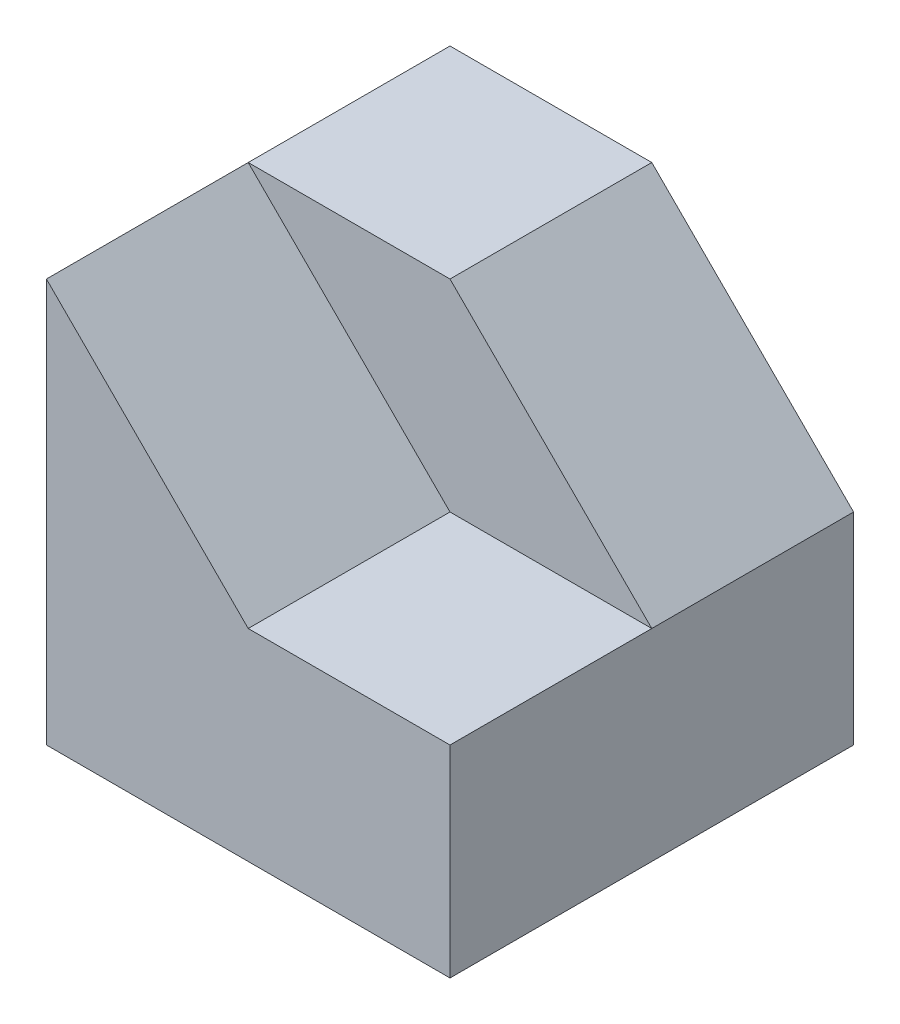
ISO-10303-21;
HEADER;
FILE_DESCRIPTION(('STEP AP214'),'2;1');
FILE_NAME('part.step','',(''),(''),'','','');
FILE_SCHEMA(('AUTOMOTIVE_DESIGN { 1 0 10303 214 1 1 1 1 }'));
ENDSEC;
DATA;
#1=APPLICATION_CONTEXT('core data for automotive mechanical design processes');
#2=APPLICATION_PROTOCOL_DEFINITION('international standard','automotive_design',2000,#1);
#3=PRODUCT_CONTEXT('',#1,'mechanical');
#4=PRODUCT('Part','Part','',(#3));
#5=PRODUCT_RELATED_PRODUCT_CATEGORY('part','',(#4));
#6=PRODUCT_DEFINITION_FORMATION('','',#4);
#7=PRODUCT_DEFINITION_CONTEXT('part definition',#1,'design');
#8=PRODUCT_DEFINITION('design','',#6,#7);
#9=PRODUCT_DEFINITION_SHAPE('','',#8);
#10=(LENGTH_UNIT() NAMED_UNIT(*) SI_UNIT(.MILLI.,.METRE.));
#11=(NAMED_UNIT(*) PLANE_ANGLE_UNIT() SI_UNIT($,.RADIAN.));
#12=(NAMED_UNIT(*) SI_UNIT($,.STERADIAN.) SOLID_ANGLE_UNIT());
#13=UNCERTAINTY_MEASURE_WITH_UNIT(LENGTH_MEASURE(1.E-05),#10,'distance_accuracy_value','');
#14=(GEOMETRIC_REPRESENTATION_CONTEXT(3) GLOBAL_UNCERTAINTY_ASSIGNED_CONTEXT((#13)) GLOBAL_UNIT_ASSIGNED_CONTEXT((#10,
#11,#12)) REPRESENTATION_CONTEXT('',''));
#15=CARTESIAN_POINT('',(0.,0.,0.));
#16=DIRECTION('',(0.,0.,1.));
#17=DIRECTION('',(1.,0.,0.));
#18=AXIS2_PLACEMENT_3D('',#15,#16,#17);
#19=CARTESIAN_POINT('',(30.,60.,-60.));
#20=DIRECTION('',(0.,1.,0.));
#21=DIRECTION('',(-1.,0.,0.));
#22=AXIS2_PLACEMENT_3D('',#19,#20,#21);
#23=PLANE('',#22);
#24=DIRECTION('',(0.,0.,1.));
#25=VECTOR('',#24,1.);
#26=CARTESIAN_POINT('',(0.,60.,-60.));
#27=LINE('',#26,#25);
#28=CARTESIAN_POINT('',(0.,60.,-60.));
#29=VERTEX_POINT('',#28);
#30=CARTESIAN_POINT('',(0.,60.,-30.));
#31=VERTEX_POINT('',#30);
#32=EDGE_CURVE('E36',#29,#31,#27,.T.);
#33=ORIENTED_EDGE('',*,*,#32,.T.);
#34=DIRECTION('',(-1.,0.,0.));
#35=VECTOR('',#34,1.);
#36=CARTESIAN_POINT('',(30.,60.,-30.));
#37=LINE('',#36,#35);
#38=CARTESIAN_POINT('',(30.,60.,-30.));
#39=VERTEX_POINT('',#38);
#40=EDGE_CURVE('E121',#39,#31,#37,.T.);
#41=ORIENTED_EDGE('',*,*,#40,.F.);
#42=DIRECTION('',(0.,0.,1.));
#43=VECTOR('',#42,1.);
#44=CARTESIAN_POINT('',(30.,60.,-60.));
#45=LINE('',#44,#43);
#46=CARTESIAN_POINT('',(30.,60.,-60.));
#47=VERTEX_POINT('',#46);
#48=EDGE_CURVE('E11',#47,#39,#45,.T.);
#49=ORIENTED_EDGE('',*,*,#48,.F.);
#50=DIRECTION('',(-1.,0.,0.));
#51=VECTOR('',#50,1.);
#52=CARTESIAN_POINT('',(30.,60.,-60.));
#53=LINE('',#52,#51);
#54=EDGE_CURVE('E106',#47,#29,#53,.T.);
#55=ORIENTED_EDGE('',*,*,#54,.T.);
#56=EDGE_LOOP('',(#33,#41,#49,#55));
#57=FACE_BOUND('',#56,.T.);
#58=ADVANCED_FACE('F33',(#57),#23,.T.);
#59=CARTESIAN_POINT('',(60.,30.,-60.));
#60=DIRECTION('',(0.707106781186548,0.707106781186547,0.));
#61=DIRECTION('',(-0.707106781186547,0.707106781186548,0.));
#62=AXIS2_PLACEMENT_3D('',#59,#60,#61);
#63=PLANE('',#62);
#64=ORIENTED_EDGE('',*,*,#48,.T.);
#65=DIRECTION('',(-0.707106781186547,0.707106781186548,0.));
#66=VECTOR('',#65,1.);
#67=CARTESIAN_POINT('',(60.,30.,-30.));
#68=LINE('',#67,#66);
#69=CARTESIAN_POINT('',(60.,30.,-30.));
#70=VERTEX_POINT('',#69);
#71=EDGE_CURVE('E150',#70,#39,#68,.T.);
#72=ORIENTED_EDGE('',*,*,#71,.F.);
#73=DIRECTION('',(0.,0.,1.));
#74=VECTOR('',#73,1.);
#75=CARTESIAN_POINT('',(60.,30.,-60.));
#76=LINE('',#75,#74);
#77=CARTESIAN_POINT('',(60.,30.,-60.));
#78=VERTEX_POINT('',#77);
#79=EDGE_CURVE('E42',#78,#70,#76,.T.);
#80=ORIENTED_EDGE('',*,*,#79,.F.);
#81=DIRECTION('',(-0.707106781186547,0.707106781186548,0.));
#82=VECTOR('',#81,1.);
#83=CARTESIAN_POINT('',(60.,30.,-60.));
#84=LINE('',#83,#82);
#85=EDGE_CURVE('E101',#78,#47,#84,.T.);
#86=ORIENTED_EDGE('',*,*,#85,.T.);
#87=EDGE_LOOP('',(#64,#72,#80,#86));
#88=FACE_BOUND('',#87,.T.);
#89=ADVANCED_FACE('F154',(#88),#63,.T.);
#90=CARTESIAN_POINT('',(60.,0.,-60.));
#91=DIRECTION('',(1.,0.,0.));
#92=DIRECTION('',(0.,1.,0.));
#93=AXIS2_PLACEMENT_3D('',#90,#91,#92);
#94=PLANE('',#93);
#95=DIRECTION('',(0.,1.,0.));
#96=VECTOR('',#95,1.);
#97=CARTESIAN_POINT('',(60.,0.,0.));
#98=LINE('',#97,#96);
#99=CARTESIAN_POINT('',(60.,0.,0.));
#100=VERTEX_POINT('',#99);
#101=CARTESIAN_POINT('',(60.,30.,0.));
#102=VERTEX_POINT('',#101);
#103=EDGE_CURVE('E93',#100,#102,#98,.T.);
#104=ORIENTED_EDGE('',*,*,#103,.F.);
#105=DIRECTION('',(0.,0.,1.));
#106=VECTOR('',#105,1.);
#107=CARTESIAN_POINT('',(60.,0.,-60.));
#108=LINE('',#107,#106);
#109=CARTESIAN_POINT('',(60.,0.,-60.));
#110=VERTEX_POINT('',#109);
#111=EDGE_CURVE('E72',#110,#100,#108,.T.);
#112=ORIENTED_EDGE('',*,*,#111,.F.);
#113=DIRECTION('',(0.,1.,0.));
#114=VECTOR('',#113,1.);
#115=CARTESIAN_POINT('',(60.,0.,-60.));
#116=LINE('',#115,#114);
#117=EDGE_CURVE('E89',#110,#78,#116,.T.);
#118=ORIENTED_EDGE('',*,*,#117,.T.);
#119=ORIENTED_EDGE('',*,*,#79,.T.);
#120=DIRECTION('',(0.,0.,1.));
#121=VECTOR('',#120,1.);
#122=CARTESIAN_POINT('',(60.,30.,-30.));
#123=LINE('',#122,#121);
#124=EDGE_CURVE('E141',#70,#102,#123,.T.);
#125=ORIENTED_EDGE('',*,*,#124,.T.);
#126=EDGE_LOOP('',(#104,#112,#118,#119,#125));
#127=FACE_BOUND('',#126,.T.);
#128=ADVANCED_FACE('F87',(#127),#94,.T.);
#129=CARTESIAN_POINT('',(0.,0.,-60.));
#130=DIRECTION('',(0.,-1.,0.));
#131=DIRECTION('',(0.,0.,-1.));
#132=AXIS2_PLACEMENT_3D('',#129,#130,#131);
#133=PLANE('',#132);
#134=DIRECTION('',(1.,0.,0.));
#135=VECTOR('',#134,1.);
#136=CARTESIAN_POINT('',(0.,0.,0.));
#137=LINE('',#136,#135);
#138=CARTESIAN_POINT('',(0.,0.,0.));
#139=VERTEX_POINT('',#138);
#140=EDGE_CURVE('E114',#139,#100,#137,.T.);
#141=ORIENTED_EDGE('',*,*,#140,.F.);
#142=DIRECTION('',(0.,0.,1.));
#143=VECTOR('',#142,1.);
#144=CARTESIAN_POINT('',(0.,0.,-60.));
#145=LINE('',#144,#143);
#146=CARTESIAN_POINT('',(0.,0.,-60.));
#147=VERTEX_POINT('',#146);
#148=EDGE_CURVE('E65',#147,#139,#145,.T.);
#149=ORIENTED_EDGE('',*,*,#148,.F.);
#150=DIRECTION('',(1.,0.,0.));
#151=VECTOR('',#150,1.);
#152=CARTESIAN_POINT('',(0.,0.,-60.));
#153=LINE('',#152,#151);
#154=EDGE_CURVE('E99',#147,#110,#153,.T.);
#155=ORIENTED_EDGE('',*,*,#154,.T.);
#156=ORIENTED_EDGE('',*,*,#111,.T.);
#157=EDGE_LOOP('',(#141,#149,#155,#156));
#158=FACE_BOUND('',#157,.T.);
#159=ADVANCED_FACE('F103',(#158),#133,.T.);
#160=CARTESIAN_POINT('',(0.,60.,-60.));
#161=DIRECTION('',(-1.,0.,0.));
#162=DIRECTION('',(0.,-1.,0.));
#163=AXIS2_PLACEMENT_3D('',#160,#161,#162);
#164=PLANE('',#163);
#165=DIRECTION('',(0.,-1.,0.));
#166=VECTOR('',#165,1.);
#167=CARTESIAN_POINT('',(0.,60.,0.));
#168=LINE('',#167,#166);
#169=CARTESIAN_POINT('',(0.,60.,0.));
#170=VERTEX_POINT('',#169);
#171=EDGE_CURVE('E111',#170,#139,#168,.T.);
#172=ORIENTED_EDGE('',*,*,#171,.F.);
#173=DIRECTION('',(0.,0.,1.));
#174=VECTOR('',#173,1.);
#175=CARTESIAN_POINT('',(0.,60.,-30.));
#176=LINE('',#175,#174);
#177=EDGE_CURVE('E145',#31,#170,#176,.T.);
#178=ORIENTED_EDGE('',*,*,#177,.F.);
#179=ORIENTED_EDGE('',*,*,#32,.F.);
#180=DIRECTION('',(0.,-1.,0.));
#181=VECTOR('',#180,1.);
#182=CARTESIAN_POINT('',(0.,60.,-60.));
#183=LINE('',#182,#181);
#184=EDGE_CURVE('E104',#29,#147,#183,.T.);
#185=ORIENTED_EDGE('',*,*,#184,.T.);
#186=ORIENTED_EDGE('',*,*,#148,.T.);
#187=EDGE_LOOP('',(#172,#178,#179,#185,#186));
#188=FACE_BOUND('',#187,.T.);
#189=ADVANCED_FACE('F167',(#188),#164,.T.);
#190=CARTESIAN_POINT('',(0.,0.,-60.));
#191=DIRECTION('',(0.,0.,1.));
#192=DIRECTION('',(1.,0.,0.));
#193=AXIS2_PLACEMENT_3D('',#190,#191,#192);
#194=PLANE('',#193);
#195=ORIENTED_EDGE('',*,*,#54,.F.);
#196=ORIENTED_EDGE('',*,*,#85,.F.);
#197=ORIENTED_EDGE('',*,*,#117,.F.);
#198=ORIENTED_EDGE('',*,*,#154,.F.);
#199=ORIENTED_EDGE('',*,*,#184,.F.);
#200=EDGE_LOOP('',(#195,#196,#197,#198,#199));
#201=FACE_BOUND('',#200,.T.);
#202=ADVANCED_FACE('F98',(#201),#194,.F.);
#203=CARTESIAN_POINT('',(0.,0.,0.));
#204=DIRECTION('',(0.,0.,1.));
#205=DIRECTION('',(1.,0.,0.));
#206=AXIS2_PLACEMENT_3D('',#203,#204,#205);
#207=PLANE('',#206);
#208=DIRECTION('',(1.,0.,0.));
#209=VECTOR('',#208,1.);
#210=CARTESIAN_POINT('',(30.,30.,0.));
#211=LINE('',#210,#209);
#212=CARTESIAN_POINT('',(30.,30.,0.));
#213=VERTEX_POINT('',#212);
#214=EDGE_CURVE('E138',#213,#102,#211,.T.);
#215=ORIENTED_EDGE('',*,*,#214,.F.);
#216=DIRECTION('',(0.707106781186547,-0.707106781186547,0.));
#217=VECTOR('',#216,1.);
#218=CARTESIAN_POINT('',(0.,60.,0.));
#219=LINE('',#218,#217);
#220=EDGE_CURVE('E151',#170,#213,#219,.T.);
#221=ORIENTED_EDGE('',*,*,#220,.F.);
#222=ORIENTED_EDGE('',*,*,#171,.T.);
#223=ORIENTED_EDGE('',*,*,#140,.T.);
#224=ORIENTED_EDGE('',*,*,#103,.T.);
#225=EDGE_LOOP('',(#215,#221,#222,#223,#224));
#226=FACE_BOUND('',#225,.T.);
#227=ADVANCED_FACE('F166',(#226),#207,.T.);
#228=CARTESIAN_POINT('',(30.,30.,-30.));
#229=DIRECTION('',(0.,-1.,0.));
#230=DIRECTION('',(0.,0.,-1.));
#231=AXIS2_PLACEMENT_3D('',#228,#229,#230);
#232=PLANE('',#231);
#233=ORIENTED_EDGE('',*,*,#214,.T.);
#234=ORIENTED_EDGE('',*,*,#124,.F.);
#235=DIRECTION('',(1.,0.,0.));
#236=VECTOR('',#235,1.);
#237=CARTESIAN_POINT('',(30.,30.,-30.));
#238=LINE('',#237,#236);
#239=CARTESIAN_POINT('',(30.,30.,-30.));
#240=VERTEX_POINT('',#239);
#241=EDGE_CURVE('E144',#240,#70,#238,.T.);
#242=ORIENTED_EDGE('',*,*,#241,.F.);
#243=DIRECTION('',(0.,0.,1.));
#244=VECTOR('',#243,1.);
#245=CARTESIAN_POINT('',(30.,30.,-30.));
#246=LINE('',#245,#244);
#247=EDGE_CURVE('E115',#240,#213,#246,.T.);
#248=ORIENTED_EDGE('',*,*,#247,.T.);
#249=EDGE_LOOP('',(#233,#234,#242,#248));
#250=FACE_BOUND('',#249,.T.);
#251=ADVANCED_FACE('F143',(#250),#232,.F.);
#252=CARTESIAN_POINT('',(0.,60.,-30.));
#253=DIRECTION('',(-0.707106781186547,-0.707106781186547,0.));
#254=DIRECTION('',(0.707106781186548,-0.707106781186548,0.));
#255=AXIS2_PLACEMENT_3D('',#252,#253,#254);
#256=PLANE('',#255);
#257=ORIENTED_EDGE('',*,*,#220,.T.);
#258=ORIENTED_EDGE('',*,*,#247,.F.);
#259=DIRECTION('',(0.707106781186547,-0.707106781186547,0.));
#260=VECTOR('',#259,1.);
#261=CARTESIAN_POINT('',(0.,60.,-30.));
#262=LINE('',#261,#260);
#263=EDGE_CURVE('E146',#31,#240,#262,.T.);
#264=ORIENTED_EDGE('',*,*,#263,.F.);
#265=ORIENTED_EDGE('',*,*,#177,.T.);
#266=EDGE_LOOP('',(#257,#258,#264,#265));
#267=FACE_BOUND('',#266,.T.);
#268=ADVANCED_FACE('F164',(#267),#256,.F.);
#269=CARTESIAN_POINT('',(0.,0.,-30.));
#270=DIRECTION('',(0.,0.,1.));
#271=DIRECTION('',(1.,0.,0.));
#272=AXIS2_PLACEMENT_3D('',#269,#270,#271);
#273=PLANE('',#272);
#274=ORIENTED_EDGE('',*,*,#241,.T.);
#275=ORIENTED_EDGE('',*,*,#71,.T.);
#276=ORIENTED_EDGE('',*,*,#40,.T.);
#277=ORIENTED_EDGE('',*,*,#263,.T.);
#278=EDGE_LOOP('',(#274,#275,#276,#277));
#279=FACE_BOUND('',#278,.T.);
#280=ADVANCED_FACE('F149',(#279),#273,.T.);
#281=CLOSED_SHELL('',(#58,#89,#128,#159,#189,#202,#227,#251,#268,#280));
#282=MANIFOLD_SOLID_BREP('B2',#281);
#283=ADVANCED_BREP_SHAPE_REPRESENTATION('',(#18,#282),#14);
#284=SHAPE_DEFINITION_REPRESENTATION(#9,#283);
ENDSEC;
END-ISO-10303-21;
